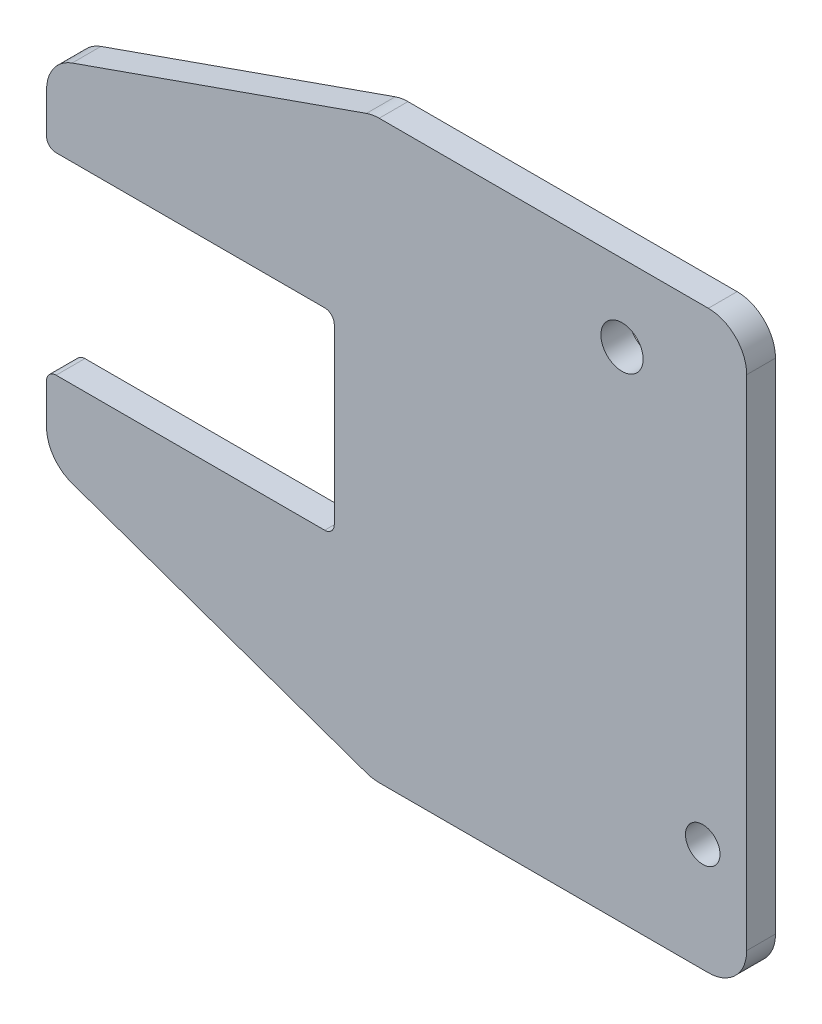
ISO-10303-21;
HEADER;
FILE_DESCRIPTION(('STEP AP214'),'2;1');
FILE_NAME('part.step','',(''),(''),'','','');
FILE_SCHEMA(('AUTOMOTIVE_DESIGN { 1 0 10303 214 1 1 1 1 }'));
ENDSEC;
DATA;
#1=APPLICATION_CONTEXT('core data for automotive mechanical design processes');
#2=APPLICATION_PROTOCOL_DEFINITION('international standard','automotive_design',2000,#1);
#3=PRODUCT_CONTEXT('',#1,'mechanical');
#4=PRODUCT('Part','Part','',(#3));
#5=PRODUCT_RELATED_PRODUCT_CATEGORY('part','',(#4));
#6=PRODUCT_DEFINITION_FORMATION('','',#4);
#7=PRODUCT_DEFINITION_CONTEXT('part definition',#1,'design');
#8=PRODUCT_DEFINITION('design','',#6,#7);
#9=PRODUCT_DEFINITION_SHAPE('','',#8);
#10=(LENGTH_UNIT() NAMED_UNIT(*) SI_UNIT(.MILLI.,.METRE.));
#11=(NAMED_UNIT(*) PLANE_ANGLE_UNIT() SI_UNIT($,.RADIAN.));
#12=(NAMED_UNIT(*) SI_UNIT($,.STERADIAN.) SOLID_ANGLE_UNIT());
#13=UNCERTAINTY_MEASURE_WITH_UNIT(LENGTH_MEASURE(1.E-05),#10,'distance_accuracy_value','');
#14=(GEOMETRIC_REPRESENTATION_CONTEXT(3) GLOBAL_UNCERTAINTY_ASSIGNED_CONTEXT((#13)) GLOBAL_UNIT_ASSIGNED_CONTEXT((#10,
#11,#12)) REPRESENTATION_CONTEXT('',''));
#15=CARTESIAN_POINT('',(0.,0.,0.));
#16=DIRECTION('',(0.,0.,1.));
#17=DIRECTION('',(1.,0.,0.));
#18=AXIS2_PLACEMENT_3D('',#15,#16,#17);
#19=CARTESIAN_POINT('',(-150.000000000001,-50.2000000000029,24.9999999999999));
#20=DIRECTION('',(-1.,0.,0.));
#21=DIRECTION('',(0.,1.,0.));
#22=AXIS2_PLACEMENT_3D('',#19,#20,#21);
#23=PLANE('',#22);
#24=DIRECTION('',(0.,0.,1.));
#25=VECTOR('',#24,1.);
#26=CARTESIAN_POINT('',(-150.000000000001,-55.2000000000029,24.9999999999999));
#27=LINE('',#26,#25);
#28=CARTESIAN_POINT('',(-150.000000000002,-55.2000000000086,10.0000000000008));
#29=VERTEX_POINT('',#28);
#30=CARTESIAN_POINT('',(-150.000000000001,-55.2000000000029,24.9999999999999));
#31=VERTEX_POINT('',#30);
#32=EDGE_CURVE('E11',#29,#31,#27,.T.);
#33=ORIENTED_EDGE('',*,*,#32,.F.);
#34=DIRECTION('',(0.,1.00000000000002,0.));
#35=VECTOR('',#34,1.);
#36=CARTESIAN_POINT('',(-150.000000000009,76.0339884191306,10.0000000000008));
#37=LINE('',#36,#35);
#38=CARTESIAN_POINT('',(-150.000000000006,-76.0339884191437,10.0000000000008));
#39=VERTEX_POINT('',#38);
#40=EDGE_CURVE('E140',#39,#29,#37,.T.);
#41=ORIENTED_EDGE('',*,*,#40,.F.);
#42=DIRECTION('',(0.,0.,1.));
#43=VECTOR('',#42,1.);
#44=CARTESIAN_POINT('',(-150.000000000006,-76.0339884191371,24.9999999999999));
#45=LINE('',#44,#43);
#46=CARTESIAN_POINT('',(-150.000000000006,-76.0339884191371,24.9999999999999));
#47=VERTEX_POINT('',#46);
#48=EDGE_CURVE('E47',#39,#47,#45,.T.);
#49=ORIENTED_EDGE('',*,*,#48,.T.);
#50=DIRECTION('',(0.,1.,0.));
#51=VECTOR('',#50,1.);
#52=CARTESIAN_POINT('',(-150.000000000001,-50.2000000000029,24.9999999999999));
#53=LINE('',#52,#51);
#54=EDGE_CURVE('E253',#47,#31,#53,.T.);
#55=ORIENTED_EDGE('',*,*,#54,.T.);
#56=EDGE_LOOP('',(#33,#41,#49,#55));
#57=FACE_BOUND('',#56,.T.);
#58=ADVANCED_FACE('F37',(#57),#23,.T.);
#59=CARTESIAN_POINT('',(-130.000000000006,-76.0339884191371,25.0000000000026));
#60=DIRECTION('',(0.,0.,-1.));
#61=DIRECTION('',(-1.,0.,0.));
#62=AXIS2_PLACEMENT_3D('',#59,#60,#61);
#63=CYLINDRICAL_SURFACE('',#62,20.);
#64=ORIENTED_EDGE('',*,*,#48,.F.);
#65=CARTESIAN_POINT('',(-130.000000000006,-76.0339884191371,10.0000000000026));
#66=DIRECTION('',(0.,0.,-1.));
#67=DIRECTION('',(-1.,0.,0.));
#68=AXIS2_PLACEMENT_3D('',#65,#66,#67);
#69=CIRCLE('',#68,20.);
#70=CARTESIAN_POINT('',(-136.636661173322,-94.9007509519835,10.0000000000008));
#71=VERTEX_POINT('',#70);
#72=EDGE_CURVE('E198',#71,#39,#69,.T.);
#73=ORIENTED_EDGE('',*,*,#72,.F.);
#74=DIRECTION('',(0.,0.,1.));
#75=VECTOR('',#74,1.);
#76=CARTESIAN_POINT('',(-136.636661173322,-94.9007509519761,24.9999999999999));
#77=LINE('',#76,#75);
#78=CARTESIAN_POINT('',(-136.636661173322,-94.9007509519761,24.9999999999999));
#79=VERTEX_POINT('',#78);
#80=EDGE_CURVE('E246',#71,#79,#77,.T.);
#81=ORIENTED_EDGE('',*,*,#80,.T.);
#82=CARTESIAN_POINT('',(-130.000000000006,-76.0339884191371,25.0000000000026));
#83=DIRECTION('',(0.,0.,-1.));
#84=DIRECTION('',(-1.00000000000002,0.,0.));
#85=AXIS2_PLACEMENT_3D('',#82,#83,#84);
#86=CIRCLE('',#85,20.);
#87=EDGE_CURVE('E263',#79,#47,#86,.T.);
#88=ORIENTED_EDGE('',*,*,#87,.T.);
#89=EDGE_LOOP('',(#64,#73,#81,#88));
#90=FACE_BOUND('',#89,.T.);
#91=ADVANCED_FACE('F266',(#90),#63,.T.);
#92=CARTESIAN_POINT('',(-136.636661173322,-94.9007509519761,24.9999999999999));
#93=DIRECTION('',(-0.331833058665816,-0.943338126642027,0.));
#94=DIRECTION('',(-0.943338126642041,0.33183305866582,0.));
#95=AXIS2_PLACEMENT_3D('',#92,#93,#94);
#96=PLANE('',#95);
#97=ORIENTED_EDGE('',*,*,#80,.F.);
#98=DIRECTION('',(-0.943338126642041,0.33183305866582,0.));
#99=VECTOR('',#98,1.);
#100=CARTESIAN_POINT('',(-136.636661173322,-94.9007509519761,9.99999999999991));
#101=LINE('',#100,#99);
#102=CARTESIAN_POINT('',(16.778421916104,-148.866762532848,10.0000000000007));
#103=VERTEX_POINT('',#102);
#104=EDGE_CURVE('E195',#103,#71,#101,.T.);
#105=ORIENTED_EDGE('',*,*,#104,.F.);
#106=DIRECTION('',(0.,0.,1.));
#107=VECTOR('',#106,1.);
#108=CARTESIAN_POINT('',(16.7784219160976,-148.866762532838,25.));
#109=LINE('',#108,#107);
#110=CARTESIAN_POINT('',(16.7784219160976,-148.866762532838,25.));
#111=VERTEX_POINT('',#110);
#112=EDGE_CURVE('E243',#103,#111,#109,.T.);
#113=ORIENTED_EDGE('',*,*,#112,.T.);
#114=DIRECTION('',(-0.943338126642041,0.33183305866582,0.));
#115=VECTOR('',#114,1.);
#116=CARTESIAN_POINT('',(-136.636661173322,-94.9007509519761,24.9999999999999));
#117=LINE('',#116,#115);
#118=EDGE_CURVE('E267',#111,#79,#117,.T.);
#119=ORIENTED_EDGE('',*,*,#118,.T.);
#120=EDGE_LOOP('',(#97,#105,#113,#119));
#121=FACE_BOUND('',#120,.T.);
#122=ADVANCED_FACE('F339',(#121),#96,.T.);
#123=CARTESIAN_POINT('',(23.4150830894156,-130.,25.));
#124=DIRECTION('',(0.,0.,-1.));
#125=DIRECTION('',(-1.,0.,0.));
#126=AXIS2_PLACEMENT_3D('',#123,#124,#125);
#127=CYLINDRICAL_SURFACE('',#126,20.);
#128=ORIENTED_EDGE('',*,*,#112,.F.);
#129=CARTESIAN_POINT('',(23.4150830894156,-130.,10.));
#130=DIRECTION('',(0.,0.,-1.));
#131=DIRECTION('',(-1.,0.,0.));
#132=AXIS2_PLACEMENT_3D('',#129,#130,#131);
#133=CIRCLE('',#132,20.);
#134=CARTESIAN_POINT('',(23.4150830894201,-150.000000000007,10.0000000000007));
#135=VERTEX_POINT('',#134);
#136=EDGE_CURVE('E192',#135,#103,#133,.T.);
#137=ORIENTED_EDGE('',*,*,#136,.F.);
#138=DIRECTION('',(0.,0.,1.));
#139=VECTOR('',#138,1.);
#140=CARTESIAN_POINT('',(23.4150830894134,-149.999999999997,25.));
#141=LINE('',#140,#139);
#142=CARTESIAN_POINT('',(23.4150830894134,-149.999999999997,25.));
#143=VERTEX_POINT('',#142);
#144=EDGE_CURVE('E240',#135,#143,#141,.T.);
#145=ORIENTED_EDGE('',*,*,#144,.T.);
#146=CARTESIAN_POINT('',(23.4150830894156,-130.,25.));
#147=DIRECTION('',(0.,0.,-1.));
#148=DIRECTION('',(-1.00000000000002,0.,0.));
#149=AXIS2_PLACEMENT_3D('',#146,#147,#148);
#150=CIRCLE('',#149,20.);
#151=EDGE_CURVE('E269',#143,#111,#150,.T.);
#152=ORIENTED_EDGE('',*,*,#151,.T.);
#153=EDGE_LOOP('',(#128,#137,#145,#152));
#154=FACE_BOUND('',#153,.T.);
#155=ADVANCED_FACE('F344',(#154),#127,.T.);
#156=CARTESIAN_POINT('',(23.4150830894134,-149.999999999997,25.));
#157=DIRECTION('',(0.,-1.,0.));
#158=DIRECTION('',(-1.00000000000002,0.,0.));
#159=AXIS2_PLACEMENT_3D('',#156,#157,#158);
#160=PLANE('',#159);
#161=ORIENTED_EDGE('',*,*,#144,.F.);
#162=DIRECTION('',(-1.00000000000002,0.,0.));
#163=VECTOR('',#162,1.);
#164=CARTESIAN_POINT('',(-129.999999999997,-150.000000000009,10.0000000000008));
#165=LINE('',#164,#163);
#166=CARTESIAN_POINT('',(195.000000000015,-150.000000000003,10.0000000000006));
#167=VERTEX_POINT('',#166);
#168=EDGE_CURVE('E189',#167,#135,#165,.T.);
#169=ORIENTED_EDGE('',*,*,#168,.F.);
#170=DIRECTION('',(0.,0.,1.));
#171=VECTOR('',#170,1.);
#172=CARTESIAN_POINT('',(195.000000000001,-149.999999999993,24.9999999999989));
#173=LINE('',#172,#171);
#174=CARTESIAN_POINT('',(195.000000000001,-149.999999999993,24.9999999999989));
#175=VERTEX_POINT('',#174);
#176=EDGE_CURVE('E237',#167,#175,#173,.T.);
#177=ORIENTED_EDGE('',*,*,#176,.T.);
#178=DIRECTION('',(-1.00000000000002,0.,0.));
#179=VECTOR('',#178,1.);
#180=CARTESIAN_POINT('',(23.4150830894134,-149.999999999997,25.));
#181=LINE('',#180,#179);
#182=EDGE_CURVE('E275',#175,#143,#181,.T.);
#183=ORIENTED_EDGE('',*,*,#182,.T.);
#184=EDGE_LOOP('',(#161,#169,#177,#183));
#185=FACE_BOUND('',#184,.T.);
#186=ADVANCED_FACE('F348',(#185),#160,.T.);
#187=CARTESIAN_POINT('',(195.,-129.999999999996,24.9999999999989));
#188=DIRECTION('',(0.,0.,-1.));
#189=DIRECTION('',(-1.,0.,0.));
#190=AXIS2_PLACEMENT_3D('',#187,#188,#189);
#191=CYLINDRICAL_SURFACE('',#190,20.);
#192=ORIENTED_EDGE('',*,*,#176,.F.);
#193=CARTESIAN_POINT('',(195.,-129.999999999996,9.99999999999891));
#194=DIRECTION('',(0.,0.,-1.));
#195=DIRECTION('',(-1.,0.,0.));
#196=AXIS2_PLACEMENT_3D('',#193,#194,#195);
#197=CIRCLE('',#196,20.);
#198=CARTESIAN_POINT('',(215.000000000015,-130.000000000005,10.0000000000005));
#199=VERTEX_POINT('',#198);
#200=EDGE_CURVE('E186',#199,#167,#197,.T.);
#201=ORIENTED_EDGE('',*,*,#200,.F.);
#202=DIRECTION('',(0.,0.,1.));
#203=VECTOR('',#202,1.);
#204=CARTESIAN_POINT('',(215.,-129.999999999996,25.0000000000008));
#205=LINE('',#204,#203);
#206=CARTESIAN_POINT('',(215.,-129.999999999996,25.0000000000008));
#207=VERTEX_POINT('',#206);
#208=EDGE_CURVE('E234',#199,#207,#205,.T.);
#209=ORIENTED_EDGE('',*,*,#208,.T.);
#210=CARTESIAN_POINT('',(195.,-129.999999999996,24.9999999999989));
#211=DIRECTION('',(0.,0.,-1.));
#212=DIRECTION('',(-1.00000000000002,0.,0.));
#213=AXIS2_PLACEMENT_3D('',#210,#211,#212);
#214=CIRCLE('',#213,20.);
#215=EDGE_CURVE('E278',#207,#175,#214,.T.);
#216=ORIENTED_EDGE('',*,*,#215,.T.);
#217=EDGE_LOOP('',(#192,#201,#209,#216));
#218=FACE_BOUND('',#217,.T.);
#219=ADVANCED_FACE('F352',(#218),#191,.T.);
#220=CARTESIAN_POINT('',(215.000000000007,130.000000000007,25.0000000000008));
#221=DIRECTION('',(-1.,0.,0.));
#222=DIRECTION('',(0.,1.,0.));
#223=AXIS2_PLACEMENT_3D('',#220,#221,#222);
#224=PLANE('',#223);
#225=ORIENTED_EDGE('',*,*,#208,.F.);
#226=DIRECTION('',(0.,1.00000000000002,0.));
#227=VECTOR('',#226,1.);
#228=CARTESIAN_POINT('',(215.000000000011,76.0339884191376,10.0000000000005));
#229=LINE('',#228,#227);
#230=CARTESIAN_POINT('',(215.000000000022,130.000000000009,10.0000000000005));
#231=VERTEX_POINT('',#230);
#232=EDGE_CURVE('E183',#199,#231,#229,.T.);
#233=ORIENTED_EDGE('',*,*,#232,.T.);
#234=DIRECTION('',(0.,0.,1.));
#235=VECTOR('',#234,1.);
#236=CARTESIAN_POINT('',(215.000000000007,130.000000000007,25.0000000000008));
#237=LINE('',#236,#235);
#238=CARTESIAN_POINT('',(215.000000000007,130.000000000007,25.0000000000008));
#239=VERTEX_POINT('',#238);
#240=EDGE_CURVE('E231',#231,#239,#237,.T.);
#241=ORIENTED_EDGE('',*,*,#240,.T.);
#242=DIRECTION('',(0.,1.,0.));
#243=VECTOR('',#242,1.);
#244=CARTESIAN_POINT('',(215.000000000007,130.000000000007,25.0000000000008));
#245=LINE('',#244,#243);
#246=EDGE_CURVE('E281',#207,#239,#245,.T.);
#247=ORIENTED_EDGE('',*,*,#246,.F.);
#248=EDGE_LOOP('',(#225,#233,#241,#247));
#249=FACE_BOUND('',#248,.T.);
#250=ADVANCED_FACE('F356',(#249),#224,.F.);
#251=CARTESIAN_POINT('',(195.000000000007,130.000000000007,25.0000000000008));
#252=DIRECTION('',(0.,0.,-1.));
#253=DIRECTION('',(-1.,0.,0.));
#254=AXIS2_PLACEMENT_3D('',#251,#252,#253);
#255=CYLINDRICAL_SURFACE('',#254,20.);
#256=ORIENTED_EDGE('',*,*,#240,.F.);
#257=CARTESIAN_POINT('',(195.000000000007,130.000000000007,10.0000000000008));
#258=DIRECTION('',(0.,0.,1.));
#259=DIRECTION('',(1.,0.,0.));
#260=AXIS2_PLACEMENT_3D('',#257,#258,#259);
#261=CIRCLE('',#260,20.);
#262=CARTESIAN_POINT('',(195.000000000024,150.00000000001,10.0000000000006));
#263=VERTEX_POINT('',#262);
#264=EDGE_CURVE('E180',#231,#263,#261,.T.);
#265=ORIENTED_EDGE('',*,*,#264,.T.);
#266=DIRECTION('',(0.,0.,1.));
#267=VECTOR('',#266,1.);
#268=CARTESIAN_POINT('',(195.000000000009,150.000000000007,25.0000000000008));
#269=LINE('',#268,#267);
#270=CARTESIAN_POINT('',(195.000000000009,150.000000000007,25.0000000000008));
#271=VERTEX_POINT('',#270);
#272=EDGE_CURVE('E228',#263,#271,#269,.T.);
#273=ORIENTED_EDGE('',*,*,#272,.T.);
#274=CARTESIAN_POINT('',(195.000000000007,130.000000000007,25.0000000000008));
#275=DIRECTION('',(0.,0.,1.));
#276=DIRECTION('',(-1.00000000000002,0.,0.));
#277=AXIS2_PLACEMENT_3D('',#274,#275,#276);
#278=CIRCLE('',#277,20.);
#279=EDGE_CURVE('E284',#239,#271,#278,.T.);
#280=ORIENTED_EDGE('',*,*,#279,.F.);
#281=EDGE_LOOP('',(#256,#265,#273,#280));
#282=FACE_BOUND('',#281,.T.);
#283=ADVANCED_FACE('F360',(#282),#255,.T.);
#284=CARTESIAN_POINT('',(23.4150830894206,150.000000000003,25.));
#285=DIRECTION('',(0.,-1.,0.));
#286=DIRECTION('',(-1.00000000000002,0.,0.));
#287=AXIS2_PLACEMENT_3D('',#284,#285,#286);
#288=PLANE('',#287);
#289=ORIENTED_EDGE('',*,*,#272,.F.);
#290=DIRECTION('',(-1.00000000000002,0.,0.));
#291=VECTOR('',#290,1.);
#292=CARTESIAN_POINT('',(-130.000000000002,150.000000000004,10.0000000000008));
#293=LINE('',#292,#291);
#294=CARTESIAN_POINT('',(23.4150830894273,150.000000000006,10.0000000000007));
#295=VERTEX_POINT('',#294);
#296=EDGE_CURVE('E177',#263,#295,#293,.T.);
#297=ORIENTED_EDGE('',*,*,#296,.T.);
#298=DIRECTION('',(0.,0.,1.));
#299=VECTOR('',#298,1.);
#300=CARTESIAN_POINT('',(23.4150830894206,150.000000000003,25.));
#301=LINE('',#300,#299);
#302=CARTESIAN_POINT('',(23.4150830894206,150.000000000003,25.));
#303=VERTEX_POINT('',#302);
#304=EDGE_CURVE('E225',#295,#303,#301,.T.);
#305=ORIENTED_EDGE('',*,*,#304,.T.);
#306=DIRECTION('',(-1.00000000000002,0.,0.));
#307=VECTOR('',#306,1.);
#308=CARTESIAN_POINT('',(23.4150830894206,150.000000000003,25.));
#309=LINE('',#308,#307);
#310=EDGE_CURVE('E287',#271,#303,#309,.T.);
#311=ORIENTED_EDGE('',*,*,#310,.F.);
#312=EDGE_LOOP('',(#289,#297,#305,#311));
#313=FACE_BOUND('',#312,.T.);
#314=ADVANCED_FACE('F364',(#313),#288,.F.);
#315=CARTESIAN_POINT('',(23.4150830894206,130.000000000003,25.));
#316=DIRECTION('',(0.,0.,-1.));
#317=DIRECTION('',(-1.,0.,0.));
#318=AXIS2_PLACEMENT_3D('',#315,#316,#317);
#319=CYLINDRICAL_SURFACE('',#318,20.);
#320=ORIENTED_EDGE('',*,*,#304,.F.);
#321=CARTESIAN_POINT('',(23.4150830894206,130.000000000003,10.));
#322=DIRECTION('',(0.,0.,1.));
#323=DIRECTION('',(1.,0.,0.));
#324=AXIS2_PLACEMENT_3D('',#321,#322,#323);
#325=CIRCLE('',#324,20.);
#326=CARTESIAN_POINT('',(16.7784219161106,148.866762532846,10.0000000000007));
#327=VERTEX_POINT('',#326);
#328=EDGE_CURVE('E174',#295,#327,#325,.T.);
#329=ORIENTED_EDGE('',*,*,#328,.T.);
#330=DIRECTION('',(0.,0.,1.));
#331=VECTOR('',#330,1.);
#332=CARTESIAN_POINT('',(16.7784219161042,148.866762532843,25.));
#333=LINE('',#332,#331);
#334=CARTESIAN_POINT('',(16.7784219161042,148.866762532843,25.));
#335=VERTEX_POINT('',#334);
#336=EDGE_CURVE('E222',#327,#335,#333,.T.);
#337=ORIENTED_EDGE('',*,*,#336,.T.);
#338=CARTESIAN_POINT('',(23.4150830894206,130.000000000003,25.));
#339=DIRECTION('',(0.,0.,1.));
#340=DIRECTION('',(-1.00000000000002,0.,0.));
#341=AXIS2_PLACEMENT_3D('',#338,#339,#340);
#342=CIRCLE('',#341,20.);
#343=EDGE_CURVE('E290',#303,#335,#342,.T.);
#344=ORIENTED_EDGE('',*,*,#343,.F.);
#345=EDGE_LOOP('',(#320,#329,#337,#344));
#346=FACE_BOUND('',#345,.T.);
#347=ADVANCED_FACE('F368',(#346),#319,.T.);
#348=CARTESIAN_POINT('',(-136.636661173317,94.9007509519727,25.0000000000008));
#349=DIRECTION('',(0.33183305866585,-0.943338126642015,0.));
#350=DIRECTION('',(-0.943338126642041,-0.331833058665859,0.));
#351=AXIS2_PLACEMENT_3D('',#348,#349,#350);
#352=PLANE('',#351);
#353=ORIENTED_EDGE('',*,*,#336,.F.);
#354=DIRECTION('',(-0.943338126642041,-0.331833058665859,0.));
#355=VECTOR('',#354,1.);
#356=CARTESIAN_POINT('',(-136.636661173317,94.9007509519727,10.0000000000008));
#357=LINE('',#356,#355);
#358=CARTESIAN_POINT('',(-136.636661173317,94.9007509519735,10.0000000000008));
#359=VERTEX_POINT('',#358);
#360=EDGE_CURVE('E171',#327,#359,#357,.T.);
#361=ORIENTED_EDGE('',*,*,#360,.T.);
#362=DIRECTION('',(0.,0.,1.));
#363=VECTOR('',#362,1.);
#364=CARTESIAN_POINT('',(-136.636661173317,94.9007509519727,25.0000000000008));
#365=LINE('',#364,#363);
#366=CARTESIAN_POINT('',(-136.636661173317,94.9007509519727,25.0000000000008));
#367=VERTEX_POINT('',#366);
#368=EDGE_CURVE('E219',#359,#367,#365,.T.);
#369=ORIENTED_EDGE('',*,*,#368,.T.);
#370=DIRECTION('',(-0.943338126642041,-0.331833058665859,0.));
#371=VECTOR('',#370,1.);
#372=CARTESIAN_POINT('',(-136.636661173317,94.9007509519727,25.0000000000008));
#373=LINE('',#372,#371);
#374=EDGE_CURVE('E293',#335,#367,#373,.T.);
#375=ORIENTED_EDGE('',*,*,#374,.F.);
#376=EDGE_LOOP('',(#353,#361,#369,#375));
#377=FACE_BOUND('',#376,.T.);
#378=ADVANCED_FACE('F372',(#377),#352,.F.);
#379=CARTESIAN_POINT('',(-130.000000000001,76.033988419131,25.0000000000008));
#380=DIRECTION('',(0.,0.,-1.));
#381=DIRECTION('',(-1.,0.,0.));
#382=AXIS2_PLACEMENT_3D('',#379,#380,#381);
#383=CYLINDRICAL_SURFACE('',#382,20.);
#384=ORIENTED_EDGE('',*,*,#368,.F.);
#385=CARTESIAN_POINT('',(-130.000000000001,76.033988419131,10.0000000000008));
#386=DIRECTION('',(0.,0.,1.));
#387=DIRECTION('',(1.,0.,0.));
#388=AXIS2_PLACEMENT_3D('',#385,#386,#387);
#389=CIRCLE('',#388,20.);
#390=CARTESIAN_POINT('',(-150.000000000001,76.033988419131,10.0000000000008));
#391=VERTEX_POINT('',#390);
#392=EDGE_CURVE('E168',#359,#391,#389,.T.);
#393=ORIENTED_EDGE('',*,*,#392,.T.);
#394=DIRECTION('',(0.,0.,1.));
#395=VECTOR('',#394,1.);
#396=CARTESIAN_POINT('',(-150.,76.033988419131,25.0000000000008));
#397=LINE('',#396,#395);
#398=CARTESIAN_POINT('',(-150.,76.033988419131,25.0000000000008));
#399=VERTEX_POINT('',#398);
#400=EDGE_CURVE('E216',#391,#399,#397,.T.);
#401=ORIENTED_EDGE('',*,*,#400,.T.);
#402=CARTESIAN_POINT('',(-130.000000000001,76.033988419131,25.0000000000008));
#403=DIRECTION('',(0.,0.,1.));
#404=DIRECTION('',(-1.00000000000002,0.,0.));
#405=AXIS2_PLACEMENT_3D('',#402,#403,#404);
#406=CIRCLE('',#405,20.);
#407=EDGE_CURVE('E296',#367,#399,#406,.T.);
#408=ORIENTED_EDGE('',*,*,#407,.F.);
#409=EDGE_LOOP('',(#384,#393,#401,#408));
#410=FACE_BOUND('',#409,.T.);
#411=ADVANCED_FACE('F376',(#410),#383,.T.);
#412=CARTESIAN_POINT('',(-150.,50.1999999999971,25.000000000001));
#413=DIRECTION('',(1.,0.,0.));
#414=DIRECTION('',(0.,-1.,0.));
#415=AXIS2_PLACEMENT_3D('',#412,#413,#414);
#416=PLANE('',#415);
#417=ORIENTED_EDGE('',*,*,#400,.F.);
#418=DIRECTION('',(0.,1.00000000000002,0.));
#419=VECTOR('',#418,1.);
#420=CARTESIAN_POINT('',(-150.000000000001,76.0339884191306,10.0000000000008));
#421=LINE('',#420,#419);
#422=CARTESIAN_POINT('',(-150.000000000001,55.1999999999959,10.0000000000008));
#423=VERTEX_POINT('',#422);
#424=EDGE_CURVE('E165',#391,#423,#421,.F.);
#425=ORIENTED_EDGE('',*,*,#424,.T.);
#426=DIRECTION('',(0.,0.,1.));
#427=VECTOR('',#426,1.);
#428=CARTESIAN_POINT('',(-150.,55.1999999999968,25.000000000001));
#429=LINE('',#428,#427);
#430=CARTESIAN_POINT('',(-150.,55.1999999999968,25.000000000001));
#431=VERTEX_POINT('',#430);
#432=EDGE_CURVE('E213',#423,#431,#429,.T.);
#433=ORIENTED_EDGE('',*,*,#432,.T.);
#434=DIRECTION('',(0.,-1.,0.));
#435=VECTOR('',#434,1.);
#436=CARTESIAN_POINT('',(-150.,50.1999999999971,25.000000000001));
#437=LINE('',#436,#435);
#438=EDGE_CURVE('E299',#399,#431,#437,.T.);
#439=ORIENTED_EDGE('',*,*,#438,.F.);
#440=EDGE_LOOP('',(#417,#425,#433,#439));
#441=FACE_BOUND('',#440,.T.);
#442=ADVANCED_FACE('F380',(#441),#416,.F.);
#443=CARTESIAN_POINT('',(-145.,55.1999999999973,25.000000000001));
#444=DIRECTION('',(0.,0.,-1.));
#445=DIRECTION('',(-1.,0.,0.));
#446=AXIS2_PLACEMENT_3D('',#443,#444,#445);
#447=CYLINDRICAL_SURFACE('',#446,5.);
#448=ORIENTED_EDGE('',*,*,#432,.F.);
#449=CARTESIAN_POINT('',(-145.,55.1999999999973,10.000000000001));
#450=DIRECTION('',(0.,0.,-1.));
#451=DIRECTION('',(-1.,0.,0.));
#452=AXIS2_PLACEMENT_3D('',#449,#450,#451);
#453=CIRCLE('',#452,5.);
#454=CARTESIAN_POINT('',(-145.,50.1999999999965,10.0000000000008));
#455=VERTEX_POINT('',#454);
#456=EDGE_CURVE('E162',#423,#455,#453,.F.);
#457=ORIENTED_EDGE('',*,*,#456,.T.);
#458=DIRECTION('',(0.,0.,1.));
#459=VECTOR('',#458,1.);
#460=CARTESIAN_POINT('',(-145.,50.1999999999977,25.000000000001));
#461=LINE('',#460,#459);
#462=CARTESIAN_POINT('',(-145.,50.1999999999977,25.000000000001));
#463=VERTEX_POINT('',#462);
#464=EDGE_CURVE('E210',#455,#463,#461,.T.);
#465=ORIENTED_EDGE('',*,*,#464,.T.);
#466=CARTESIAN_POINT('',(-145.,55.1999999999973,25.000000000001));
#467=DIRECTION('',(0.,0.,-1.));
#468=DIRECTION('',(-1.00000000000002,0.,0.));
#469=AXIS2_PLACEMENT_3D('',#466,#467,#468);
#470=CIRCLE('',#469,5.);
#471=EDGE_CURVE('E302',#431,#463,#470,.F.);
#472=ORIENTED_EDGE('',*,*,#471,.F.);
#473=EDGE_LOOP('',(#448,#457,#465,#472));
#474=FACE_BOUND('',#473,.T.);
#475=ADVANCED_FACE('F384',(#474),#447,.T.);
#476=CARTESIAN_POINT('',(0.,50.2,25.));
#477=DIRECTION('',(0.,1.,0.));
#478=DIRECTION('',(1.00000000000002,0.,0.));
#479=AXIS2_PLACEMENT_3D('',#476,#477,#478);
#480=PLANE('',#479);
#481=ORIENTED_EDGE('',*,*,#464,.F.);
#482=DIRECTION('',(-1.00000000000002,0.,0.));
#483=VECTOR('',#482,1.);
#484=CARTESIAN_POINT('',(-130.,50.1999999999968,10.0000000000008));
#485=LINE('',#484,#483);
#486=CARTESIAN_POINT('',(-4.99999999999457,50.1999999999989,10.0000000000007));
#487=VERTEX_POINT('',#486);
#488=EDGE_CURVE('E159',#455,#487,#485,.F.);
#489=ORIENTED_EDGE('',*,*,#488,.T.);
#490=DIRECTION('',(0.,0.,1.));
#491=VECTOR('',#490,1.);
#492=CARTESIAN_POINT('',(-5.,50.2,25.));
#493=LINE('',#492,#491);
#494=CARTESIAN_POINT('',(-5.,50.2,25.));
#495=VERTEX_POINT('',#494);
#496=EDGE_CURVE('E207',#487,#495,#493,.T.);
#497=ORIENTED_EDGE('',*,*,#496,.T.);
#498=DIRECTION('',(1.00000000000002,0.,0.));
#499=VECTOR('',#498,1.);
#500=CARTESIAN_POINT('',(0.,50.2,25.));
#501=LINE('',#500,#499);
#502=EDGE_CURVE('E305',#463,#495,#501,.T.);
#503=ORIENTED_EDGE('',*,*,#502,.F.);
#504=EDGE_LOOP('',(#481,#489,#497,#503));
#505=FACE_BOUND('',#504,.T.);
#506=ADVANCED_FACE('F388',(#505),#480,.F.);
#507=CARTESIAN_POINT('',(-5.,45.2,25.));
#508=DIRECTION('',(0.,0.,-1.));
#509=DIRECTION('',(-1.,0.,0.));
#510=AXIS2_PLACEMENT_3D('',#507,#508,#509);
#511=CYLINDRICAL_SURFACE('',#510,5.);
#512=ORIENTED_EDGE('',*,*,#496,.F.);
#513=CARTESIAN_POINT('',(-4.99999999999999,45.2,10.));
#514=DIRECTION('',(0.,0.,-1.));
#515=DIRECTION('',(-1.,0.,0.));
#516=AXIS2_PLACEMENT_3D('',#513,#514,#515);
#517=CIRCLE('',#516,5.);
#518=CARTESIAN_POINT('',(5.66635949426981E-12,45.1999999999986,10.0000000000007));
#519=VERTEX_POINT('',#518);
#520=EDGE_CURVE('E156',#487,#519,#517,.T.);
#521=ORIENTED_EDGE('',*,*,#520,.T.);
#522=DIRECTION('',(0.,0.,1.));
#523=VECTOR('',#522,1.);
#524=CARTESIAN_POINT('',(0.,45.2,25.));
#525=LINE('',#524,#523);
#526=CARTESIAN_POINT('',(0.,45.2,25.));
#527=VERTEX_POINT('',#526);
#528=EDGE_CURVE('E204',#519,#527,#525,.T.);
#529=ORIENTED_EDGE('',*,*,#528,.T.);
#530=CARTESIAN_POINT('',(-5.,45.2,25.));
#531=DIRECTION('',(0.,0.,-1.));
#532=DIRECTION('',(-1.00000000000002,0.,0.));
#533=AXIS2_PLACEMENT_3D('',#530,#531,#532);
#534=CIRCLE('',#533,5.);
#535=EDGE_CURVE('E308',#495,#527,#534,.T.);
#536=ORIENTED_EDGE('',*,*,#535,.F.);
#537=EDGE_LOOP('',(#512,#521,#529,#536));
#538=FACE_BOUND('',#537,.T.);
#539=ADVANCED_FACE('F392',(#538),#511,.F.);
#540=CARTESIAN_POINT('',(0.,0.,25.));
#541=DIRECTION('',(1.,0.,0.));
#542=DIRECTION('',(0.,-1.,0.));
#543=AXIS2_PLACEMENT_3D('',#540,#541,#542);
#544=PLANE('',#543);
#545=ORIENTED_EDGE('',*,*,#528,.F.);
#546=DIRECTION('',(0.,1.00000000000002,0.));
#547=VECTOR('',#546,1.);
#548=CARTESIAN_POINT('',(5.07927033766009E-12,76.0339884191335,10.0000000000007));
#549=LINE('',#548,#547);
#550=CARTESIAN_POINT('',(2.94671276422709E-12,-45.2000000000052,10.0000000000007));
#551=VERTEX_POINT('',#550);
#552=EDGE_CURVE('E153',#519,#551,#549,.F.);
#553=ORIENTED_EDGE('',*,*,#552,.T.);
#554=DIRECTION('',(0.,0.,1.));
#555=VECTOR('',#554,1.);
#556=CARTESIAN_POINT('',(-2.72004641033163E-12,-45.2,25.));
#557=LINE('',#556,#555);
#558=CARTESIAN_POINT('',(-2.72004641033163E-12,-45.2,25.));
#559=VERTEX_POINT('',#558);
#560=EDGE_CURVE('E202',#551,#559,#557,.T.);
#561=ORIENTED_EDGE('',*,*,#560,.T.);
#562=DIRECTION('',(0.,-1.,0.));
#563=VECTOR('',#562,1.);
#564=CARTESIAN_POINT('',(0.,0.,25.));
#565=LINE('',#564,#563);
#566=EDGE_CURVE('E311',#527,#559,#565,.T.);
#567=ORIENTED_EDGE('',*,*,#566,.F.);
#568=EDGE_LOOP('',(#545,#553,#561,#567));
#569=FACE_BOUND('',#568,.T.);
#570=ADVANCED_FACE('F396',(#569),#544,.F.);
#571=CARTESIAN_POINT('',(-5.00000000000272,-45.2,25.));
#572=DIRECTION('',(0.,0.,-1.));
#573=DIRECTION('',(-1.,0.,0.));
#574=AXIS2_PLACEMENT_3D('',#571,#572,#573);
#575=CYLINDRICAL_SURFACE('',#574,5.);
#576=ORIENTED_EDGE('',*,*,#560,.F.);
#577=CARTESIAN_POINT('',(-5.00000000000271,-45.2,10.));
#578=DIRECTION('',(0.,0.,-1.));
#579=DIRECTION('',(-1.,0.,0.));
#580=AXIS2_PLACEMENT_3D('',#577,#578,#579);
#581=CIRCLE('',#580,5.);
#582=CARTESIAN_POINT('',(-4.9999999999973,-50.2000000000055,10.0000000000007));
#583=VERTEX_POINT('',#582);
#584=EDGE_CURVE('E150',#551,#583,#581,.T.);
#585=ORIENTED_EDGE('',*,*,#584,.T.);
#586=DIRECTION('',(0.,0.,1.));
#587=VECTOR('',#586,1.);
#588=CARTESIAN_POINT('',(-5.00000000000272,-50.2,25.));
#589=LINE('',#588,#587);
#590=CARTESIAN_POINT('',(-5.00000000000272,-50.2,25.));
#591=VERTEX_POINT('',#590);
#592=EDGE_CURVE('E55',#583,#591,#589,.T.);
#593=ORIENTED_EDGE('',*,*,#592,.T.);
#594=CARTESIAN_POINT('',(-5.00000000000272,-45.2,25.));
#595=DIRECTION('',(0.,0.,-1.));
#596=DIRECTION('',(-1.00000000000002,0.,0.));
#597=AXIS2_PLACEMENT_3D('',#594,#595,#596);
#598=CIRCLE('',#597,5.);
#599=EDGE_CURVE('E133',#559,#591,#598,.T.);
#600=ORIENTED_EDGE('',*,*,#599,.F.);
#601=EDGE_LOOP('',(#576,#585,#593,#600));
#602=FACE_BOUND('',#601,.T.);
#603=ADVANCED_FACE('F331',(#602),#575,.F.);
#604=CARTESIAN_POINT('',(-2.72004641033163E-12,-50.2,25.));
#605=DIRECTION('',(0.,1.,0.));
#606=DIRECTION('',(1.00000000000002,0.,0.));
#607=AXIS2_PLACEMENT_3D('',#604,#605,#606);
#608=PLANE('',#607);
#609=ORIENTED_EDGE('',*,*,#592,.F.);
#610=DIRECTION('',(-1.00000000000002,0.,0.));
#611=VECTOR('',#610,1.);
#612=CARTESIAN_POINT('',(-129.999999999998,-50.2000000000075,10.0000000000008));
#613=LINE('',#612,#611);
#614=CARTESIAN_POINT('',(-145.000000000001,-50.2000000000078,10.0000000000008));
#615=VERTEX_POINT('',#614);
#616=EDGE_CURVE('E138',#615,#583,#613,.F.);
#617=ORIENTED_EDGE('',*,*,#616,.F.);
#618=DIRECTION('',(0.,0.,1.));
#619=VECTOR('',#618,1.);
#620=CARTESIAN_POINT('',(-145.000000000001,-50.2000000000022,25.0000000000001));
#621=LINE('',#620,#619);
#622=CARTESIAN_POINT('',(-145.000000000001,-50.2000000000022,25.0000000000001));
#623=VERTEX_POINT('',#622);
#624=EDGE_CURVE('E41',#615,#623,#621,.T.);
#625=ORIENTED_EDGE('',*,*,#624,.T.);
#626=DIRECTION('',(1.00000000000002,0.,0.));
#627=VECTOR('',#626,1.);
#628=CARTESIAN_POINT('',(-2.72004641033163E-12,-50.2,25.));
#629=LINE('',#628,#627);
#630=EDGE_CURVE('E462',#623,#591,#629,.T.);
#631=ORIENTED_EDGE('',*,*,#630,.T.);
#632=EDGE_LOOP('',(#609,#617,#625,#631));
#633=FACE_BOUND('',#632,.T.);
#634=ADVANCED_FACE('F142',(#633),#608,.T.);
#635=CARTESIAN_POINT('',(150.000000000005,110.000000000004,25.0000000000008));
#636=DIRECTION('',(0.,0.,-1.));
#637=DIRECTION('',(-1.,0.,0.));
#638=AXIS2_PLACEMENT_3D('',#635,#636,#637);
#639=CYLINDRICAL_SURFACE('',#638,11.);
#640=CARTESIAN_POINT('',(150.000000000005,110.000000000004,25.0000000000008));
#641=DIRECTION('',(0.,0.,1.));
#642=DIRECTION('',(1.00000000000002,0.,0.));
#643=AXIS2_PLACEMENT_3D('',#640,#641,#642);
#644=CIRCLE('',#643,11.);
#645=CARTESIAN_POINT('',(161.000000000006,110.000000000004,25.0000000000008));
#646=VERTEX_POINT('',#645);
#647=EDGE_CURVE('E152',#646,#646,#644,.T.);
#648=ORIENTED_EDGE('',*,*,#647,.T.);
#649=EDGE_LOOP('',(#648));
#650=FACE_BOUND('',#649,.T.);
#651=CARTESIAN_POINT('',(150.000000000005,110.000000000004,10.0000000000008));
#652=DIRECTION('',(0.,0.,1.));
#653=DIRECTION('',(1.,0.,0.));
#654=AXIS2_PLACEMENT_3D('',#651,#652,#653);
#655=CIRCLE('',#654,11.);
#656=CARTESIAN_POINT('',(161.000000000006,110.000000000004,10.0000000000008));
#657=VERTEX_POINT('',#656);
#658=EDGE_CURVE('E146',#657,#657,#655,.T.);
#659=ORIENTED_EDGE('',*,*,#658,.F.);
#660=EDGE_LOOP('',(#659));
#661=FACE_BOUND('',#660,.T.);
#662=ADVANCED_FACE('F320',(#650,#661),#639,.F.);
#663=CARTESIAN_POINT('',(192.084874728468,-93.521313989685,24.9999999999996));
#664=DIRECTION('',(0.,0.,-1.));
#665=DIRECTION('',(-1.,0.,0.));
#666=AXIS2_PLACEMENT_3D('',#663,#664,#665);
#667=CYLINDRICAL_SURFACE('',#666,9.00000000000001);
#668=CARTESIAN_POINT('',(192.084874728468,-93.521313989685,24.9999999999996));
#669=DIRECTION('',(0.,0.,1.));
#670=DIRECTION('',(1.00000000000002,0.,0.));
#671=AXIS2_PLACEMENT_3D('',#668,#669,#670);
#672=CIRCLE('',#671,9.00000000000001);
#673=CARTESIAN_POINT('',(201.084874728468,-93.5213139896848,24.9999999999996));
#674=VERTEX_POINT('',#673);
#675=EDGE_CURVE('E463',#674,#674,#672,.T.);
#676=ORIENTED_EDGE('',*,*,#675,.T.);
#677=EDGE_LOOP('',(#676));
#678=FACE_BOUND('',#677,.T.);
#679=CARTESIAN_POINT('',(192.084874728468,-93.521313989685,9.99999999999958));
#680=DIRECTION('',(0.,0.,1.));
#681=DIRECTION('',(1.,0.,0.));
#682=AXIS2_PLACEMENT_3D('',#679,#680,#681);
#683=CIRCLE('',#682,9.00000000000001);
#684=CARTESIAN_POINT('',(201.084874728468,-93.521313989685,9.99999999999959));
#685=VERTEX_POINT('',#684);
#686=EDGE_CURVE('E143',#685,#685,#683,.T.);
#687=ORIENTED_EDGE('',*,*,#686,.F.);
#688=EDGE_LOOP('',(#687));
#689=FACE_BOUND('',#688,.T.);
#690=ADVANCED_FACE('F322',(#678,#689),#667,.F.);
#691=CARTESIAN_POINT('',(-145.000000000001,-55.2000000000022,25.0000000000001));
#692=DIRECTION('',(0.,0.,-1.));
#693=DIRECTION('',(-1.,0.,0.));
#694=AXIS2_PLACEMENT_3D('',#691,#692,#693);
#695=CYLINDRICAL_SURFACE('',#694,5.);
#696=CARTESIAN_POINT('',(-145.000000000001,-55.2000000000022,10.0000000000001));
#697=DIRECTION('',(0.,0.,-1.));
#698=DIRECTION('',(-1.,0.,0.));
#699=AXIS2_PLACEMENT_3D('',#696,#697,#698);
#700=CIRCLE('',#699,5.);
#701=EDGE_CURVE('E127',#615,#29,#700,.F.);
#702=ORIENTED_EDGE('',*,*,#701,.T.);
#703=ORIENTED_EDGE('',*,*,#32,.T.);
#704=CARTESIAN_POINT('',(-145.000000000001,-55.2000000000022,25.0000000000001));
#705=DIRECTION('',(0.,0.,-1.));
#706=DIRECTION('',(-1.00000000000002,0.,0.));
#707=AXIS2_PLACEMENT_3D('',#704,#705,#706);
#708=CIRCLE('',#707,5.);
#709=EDGE_CURVE('E129',#623,#31,#708,.F.);
#710=ORIENTED_EDGE('',*,*,#709,.F.);
#711=ORIENTED_EDGE('',*,*,#624,.F.);
#712=EDGE_LOOP('',(#702,#703,#710,#711));
#713=FACE_BOUND('',#712,.T.);
#714=ADVANCED_FACE('F39',(#713),#695,.T.);
#715=CARTESIAN_POINT('',(-130.000000000001,76.033988419131,25.0000000000008));
#716=DIRECTION('',(0.,0.,-1.));
#717=DIRECTION('',(-1.00000000000002,0.,0.));
#718=AXIS2_PLACEMENT_3D('',#715,#716,#717);
#719=PLANE('',#718);
#720=ORIENTED_EDGE('',*,*,#647,.F.);
#721=EDGE_LOOP('',(#720));
#722=FACE_BOUND('',#721,.T.);
#723=ORIENTED_EDGE('',*,*,#675,.F.);
#724=EDGE_LOOP('',(#723));
#725=FACE_BOUND('',#724,.T.);
#726=ORIENTED_EDGE('',*,*,#630,.F.);
#727=ORIENTED_EDGE('',*,*,#709,.T.);
#728=ORIENTED_EDGE('',*,*,#54,.F.);
#729=ORIENTED_EDGE('',*,*,#87,.F.);
#730=ORIENTED_EDGE('',*,*,#118,.F.);
#731=ORIENTED_EDGE('',*,*,#151,.F.);
#732=ORIENTED_EDGE('',*,*,#182,.F.);
#733=ORIENTED_EDGE('',*,*,#215,.F.);
#734=ORIENTED_EDGE('',*,*,#246,.T.);
#735=ORIENTED_EDGE('',*,*,#279,.T.);
#736=ORIENTED_EDGE('',*,*,#310,.T.);
#737=ORIENTED_EDGE('',*,*,#343,.T.);
#738=ORIENTED_EDGE('',*,*,#374,.T.);
#739=ORIENTED_EDGE('',*,*,#407,.T.);
#740=ORIENTED_EDGE('',*,*,#438,.T.);
#741=ORIENTED_EDGE('',*,*,#471,.T.);
#742=ORIENTED_EDGE('',*,*,#502,.T.);
#743=ORIENTED_EDGE('',*,*,#535,.T.);
#744=ORIENTED_EDGE('',*,*,#566,.T.);
#745=ORIENTED_EDGE('',*,*,#599,.T.);
#746=EDGE_LOOP('',(#726,#727,#728,#729,#730,#731,#732,#733,#734,#735,#736,#737,#738,#739,#740,
#741,#742,#743,#744,#745));
#747=FACE_BOUND('',#746,.T.);
#748=ADVANCED_FACE('F261',(#722,#725,#747),#719,.F.);
#749=CARTESIAN_POINT('',(-130.000000000001,76.033988419131,10.0000000000008));
#750=DIRECTION('',(0.,0.,-1.));
#751=DIRECTION('',(-1.00000000000002,0.,0.));
#752=AXIS2_PLACEMENT_3D('',#749,#750,#751);
#753=PLANE('',#752);
#754=ORIENTED_EDGE('',*,*,#658,.T.);
#755=EDGE_LOOP('',(#754));
#756=FACE_BOUND('',#755,.T.);
#757=ORIENTED_EDGE('',*,*,#686,.T.);
#758=EDGE_LOOP('',(#757));
#759=FACE_BOUND('',#758,.T.);
#760=ORIENTED_EDGE('',*,*,#616,.T.);
#761=ORIENTED_EDGE('',*,*,#584,.F.);
#762=ORIENTED_EDGE('',*,*,#552,.F.);
#763=ORIENTED_EDGE('',*,*,#520,.F.);
#764=ORIENTED_EDGE('',*,*,#488,.F.);
#765=ORIENTED_EDGE('',*,*,#456,.F.);
#766=ORIENTED_EDGE('',*,*,#424,.F.);
#767=ORIENTED_EDGE('',*,*,#392,.F.);
#768=ORIENTED_EDGE('',*,*,#360,.F.);
#769=ORIENTED_EDGE('',*,*,#328,.F.);
#770=ORIENTED_EDGE('',*,*,#296,.F.);
#771=ORIENTED_EDGE('',*,*,#264,.F.);
#772=ORIENTED_EDGE('',*,*,#232,.F.);
#773=ORIENTED_EDGE('',*,*,#200,.T.);
#774=ORIENTED_EDGE('',*,*,#168,.T.);
#775=ORIENTED_EDGE('',*,*,#136,.T.);
#776=ORIENTED_EDGE('',*,*,#104,.T.);
#777=ORIENTED_EDGE('',*,*,#72,.T.);
#778=ORIENTED_EDGE('',*,*,#40,.T.);
#779=ORIENTED_EDGE('',*,*,#701,.F.);
#780=EDGE_LOOP('',(#760,#761,#762,#763,#764,#765,#766,#767,#768,#769,#770,#771,#772,#773,#774,
#775,#776,#777,#778,#779));
#781=FACE_BOUND('',#780,.T.);
#782=ADVANCED_FACE('F136',(#756,#759,#781),#753,.T.);
#783=CLOSED_SHELL('',(#58,#91,#122,#155,#186,#219,#250,#283,#314,#347,#378,#411,#442,#475,#506,
#539,#570,#603,#634,#662,#690,#714,#748,#782));
#784=MANIFOLD_SOLID_BREP('B2',#783);
#785=ADVANCED_BREP_SHAPE_REPRESENTATION('',(#18,#784),#14);
#786=SHAPE_DEFINITION_REPRESENTATION(#9,#785);
ENDSEC;
END-ISO-10303-21;
